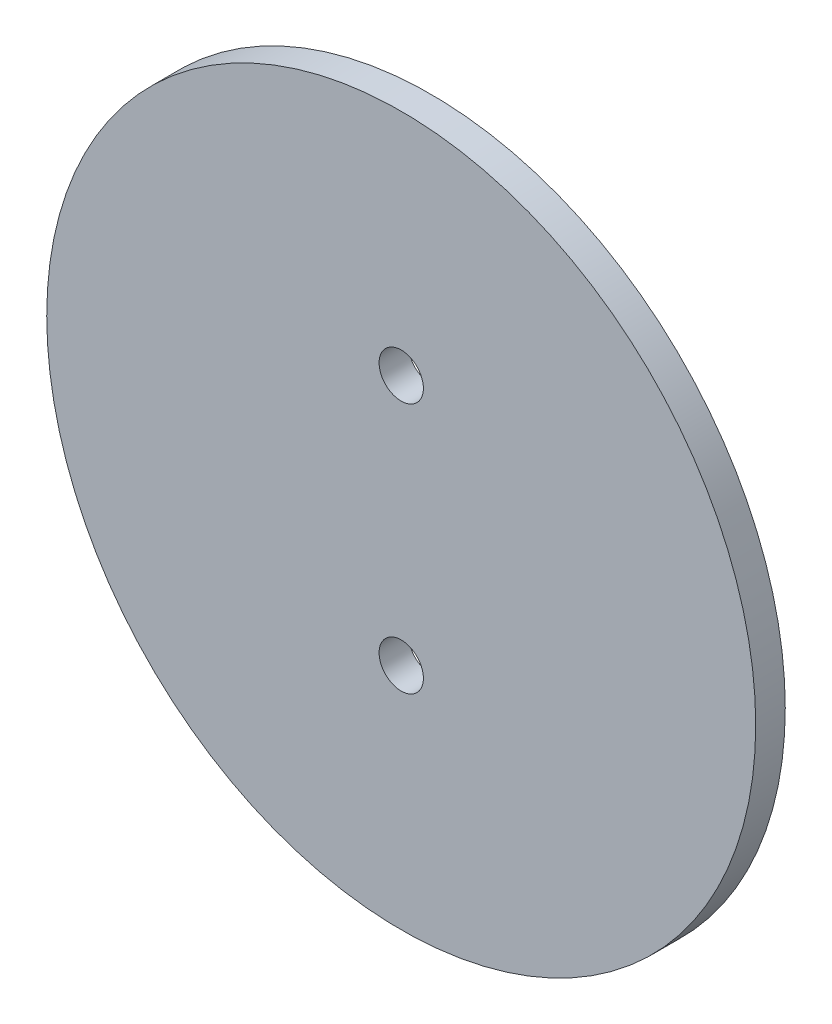
ISO-10303-21;
HEADER;
FILE_DESCRIPTION(('STEP AP214'),'2;1');
FILE_NAME('part.step','',(''),(''),'','','');
FILE_SCHEMA(('AUTOMOTIVE_DESIGN { 1 0 10303 214 1 1 1 1 }'));
ENDSEC;
DATA;
#1=APPLICATION_CONTEXT('core data for automotive mechanical design processes');
#2=APPLICATION_PROTOCOL_DEFINITION('international standard','automotive_design',2000,#1);
#3=PRODUCT_CONTEXT('',#1,'mechanical');
#4=PRODUCT('Part','Part','',(#3));
#5=PRODUCT_RELATED_PRODUCT_CATEGORY('part','',(#4));
#6=PRODUCT_DEFINITION_FORMATION('','',#4);
#7=PRODUCT_DEFINITION_CONTEXT('part definition',#1,'design');
#8=PRODUCT_DEFINITION('design','',#6,#7);
#9=PRODUCT_DEFINITION_SHAPE('','',#8);
#10=(LENGTH_UNIT() NAMED_UNIT(*) SI_UNIT(.MILLI.,.METRE.));
#11=(NAMED_UNIT(*) PLANE_ANGLE_UNIT() SI_UNIT($,.RADIAN.));
#12=(NAMED_UNIT(*) SI_UNIT($,.STERADIAN.) SOLID_ANGLE_UNIT());
#13=UNCERTAINTY_MEASURE_WITH_UNIT(LENGTH_MEASURE(1.E-05),#10,'distance_accuracy_value','');
#14=(GEOMETRIC_REPRESENTATION_CONTEXT(3) GLOBAL_UNCERTAINTY_ASSIGNED_CONTEXT((#13)) GLOBAL_UNIT_ASSIGNED_CONTEXT((#10,
#11,#12)) REPRESENTATION_CONTEXT('',''));
#15=CARTESIAN_POINT('',(0.,0.,0.));
#16=DIRECTION('',(0.,0.,1.));
#17=DIRECTION('',(1.,0.,0.));
#18=AXIS2_PLACEMENT_3D('',#15,#16,#17);
#19=CARTESIAN_POINT('',(0.,0.,6.35));
#20=DIRECTION('',(0.,0.,1.));
#21=DIRECTION('',(1.,0.,0.));
#22=AXIS2_PLACEMENT_3D('',#19,#20,#21);
#23=PLANE('',#22);
#24=CARTESIAN_POINT('',(0.,26.9875,6.35));
#25=DIRECTION('',(0.,0.,1.));
#26=DIRECTION('',(1.,0.,0.));
#27=AXIS2_PLACEMENT_3D('',#24,#25,#26);
#28=CIRCLE('',#27,4.7625);
#29=CARTESIAN_POINT('',(4.76250000000001,26.9875,6.35));
#30=VERTEX_POINT('',#29);
#31=EDGE_CURVE('E56',#30,#30,#28,.T.);
#32=ORIENTED_EDGE('',*,*,#31,.F.);
#33=EDGE_LOOP('',(#32));
#34=FACE_BOUND('',#33,.T.);
#35=CARTESIAN_POINT('',(0.,0.,6.35));
#36=DIRECTION('',(0.,0.,1.));
#37=DIRECTION('',(1.,0.,0.));
#38=AXIS2_PLACEMENT_3D('',#35,#36,#37);
#39=CIRCLE('',#38,76.2);
#40=CARTESIAN_POINT('',(76.2,0.,6.35));
#41=VERTEX_POINT('',#40);
#42=EDGE_CURVE('E10',#41,#41,#39,.T.);
#43=ORIENTED_EDGE('',*,*,#42,.T.);
#44=EDGE_LOOP('',(#43));
#45=FACE_BOUND('',#44,.T.);
#46=CARTESIAN_POINT('',(0.,-26.9875,6.35));
#47=DIRECTION('',(0.,0.,1.));
#48=DIRECTION('',(1.,0.,0.));
#49=AXIS2_PLACEMENT_3D('',#46,#47,#48);
#50=CIRCLE('',#49,4.7625);
#51=CARTESIAN_POINT('',(4.76250000000001,-26.9875,6.35));
#52=VERTEX_POINT('',#51);
#53=EDGE_CURVE('E62',#52,#52,#50,.T.);
#54=ORIENTED_EDGE('',*,*,#53,.F.);
#55=EDGE_LOOP('',(#54));
#56=FACE_BOUND('',#55,.T.);
#57=ADVANCED_FACE('F43',(#34,#45,#56),#23,.T.);
#58=CARTESIAN_POINT('',(0.,0.,0.));
#59=DIRECTION('',(0.,0.,1.));
#60=DIRECTION('',(1.,0.,0.));
#61=AXIS2_PLACEMENT_3D('',#58,#59,#60);
#62=PLANE('',#61);
#63=CARTESIAN_POINT('',(0.,0.,0.));
#64=DIRECTION('',(0.,0.,1.));
#65=DIRECTION('',(1.,0.,0.));
#66=AXIS2_PLACEMENT_3D('',#63,#64,#65);
#67=CIRCLE('',#66,76.2);
#68=CARTESIAN_POINT('',(76.2,0.,0.));
#69=VERTEX_POINT('',#68);
#70=EDGE_CURVE('E47',#69,#69,#67,.T.);
#71=ORIENTED_EDGE('',*,*,#70,.F.);
#72=EDGE_LOOP('',(#71));
#73=FACE_BOUND('',#72,.T.);
#74=CARTESIAN_POINT('',(0.,26.9875,0.));
#75=DIRECTION('',(0.,0.,1.));
#76=DIRECTION('',(1.,0.,0.));
#77=AXIS2_PLACEMENT_3D('',#74,#75,#76);
#78=CIRCLE('',#77,4.7625);
#79=CARTESIAN_POINT('',(4.76250000000001,26.9875,0.));
#80=VERTEX_POINT('',#79);
#81=EDGE_CURVE('E58',#80,#80,#78,.T.);
#82=ORIENTED_EDGE('',*,*,#81,.T.);
#83=EDGE_LOOP('',(#82));
#84=FACE_BOUND('',#83,.T.);
#85=CARTESIAN_POINT('',(0.,-26.9875,0.));
#86=DIRECTION('',(0.,0.,1.));
#87=DIRECTION('',(1.,0.,0.));
#88=AXIS2_PLACEMENT_3D('',#85,#86,#87);
#89=CIRCLE('',#88,4.7625);
#90=CARTESIAN_POINT('',(4.76250000000001,-26.9875,0.));
#91=VERTEX_POINT('',#90);
#92=EDGE_CURVE('E66',#91,#91,#89,.T.);
#93=ORIENTED_EDGE('',*,*,#92,.T.);
#94=EDGE_LOOP('',(#93));
#95=FACE_BOUND('',#94,.T.);
#96=ADVANCED_FACE('F78',(#73,#84,#95),#62,.F.);
#97=CARTESIAN_POINT('',(0.,0.,6.35));
#98=DIRECTION('',(0.,0.,-1.));
#99=DIRECTION('',(-1.,0.,0.));
#100=AXIS2_PLACEMENT_3D('',#97,#98,#99);
#101=CYLINDRICAL_SURFACE('',#100,76.2);
#102=ORIENTED_EDGE('',*,*,#42,.F.);
#103=EDGE_LOOP('',(#102));
#104=FACE_BOUND('',#103,.T.);
#105=ORIENTED_EDGE('',*,*,#70,.T.);
#106=EDGE_LOOP('',(#105));
#107=FACE_BOUND('',#106,.T.);
#108=ADVANCED_FACE('F45',(#104,#107),#101,.T.);
#109=CARTESIAN_POINT('',(0.,26.9875,6.35));
#110=DIRECTION('',(0.,0.,-1.));
#111=DIRECTION('',(-1.,0.,0.));
#112=AXIS2_PLACEMENT_3D('',#109,#110,#111);
#113=CYLINDRICAL_SURFACE('',#112,4.7625);
#114=ORIENTED_EDGE('',*,*,#31,.T.);
#115=EDGE_LOOP('',(#114));
#116=FACE_BOUND('',#115,.T.);
#117=ORIENTED_EDGE('',*,*,#81,.F.);
#118=EDGE_LOOP('',(#117));
#119=FACE_BOUND('',#118,.T.);
#120=ADVANCED_FACE('F87',(#116,#119),#113,.F.);
#121=CARTESIAN_POINT('',(0.,-26.9875,6.35));
#122=DIRECTION('',(0.,0.,-1.));
#123=DIRECTION('',(-1.,0.,0.));
#124=AXIS2_PLACEMENT_3D('',#121,#122,#123);
#125=CYLINDRICAL_SURFACE('',#124,4.7625);
#126=ORIENTED_EDGE('',*,*,#53,.T.);
#127=EDGE_LOOP('',(#126));
#128=FACE_BOUND('',#127,.T.);
#129=ORIENTED_EDGE('',*,*,#92,.F.);
#130=EDGE_LOOP('',(#129));
#131=FACE_BOUND('',#130,.T.);
#132=ADVANCED_FACE('F74',(#128,#131),#125,.F.);
#133=CLOSED_SHELL('',(#57,#96,#108,#120,#132));
#134=MANIFOLD_SOLID_BREP('B2',#133);
#135=ADVANCED_BREP_SHAPE_REPRESENTATION('',(#18,#134),#14);
#136=SHAPE_DEFINITION_REPRESENTATION(#9,#135);
ENDSEC;
END-ISO-10303-21;
